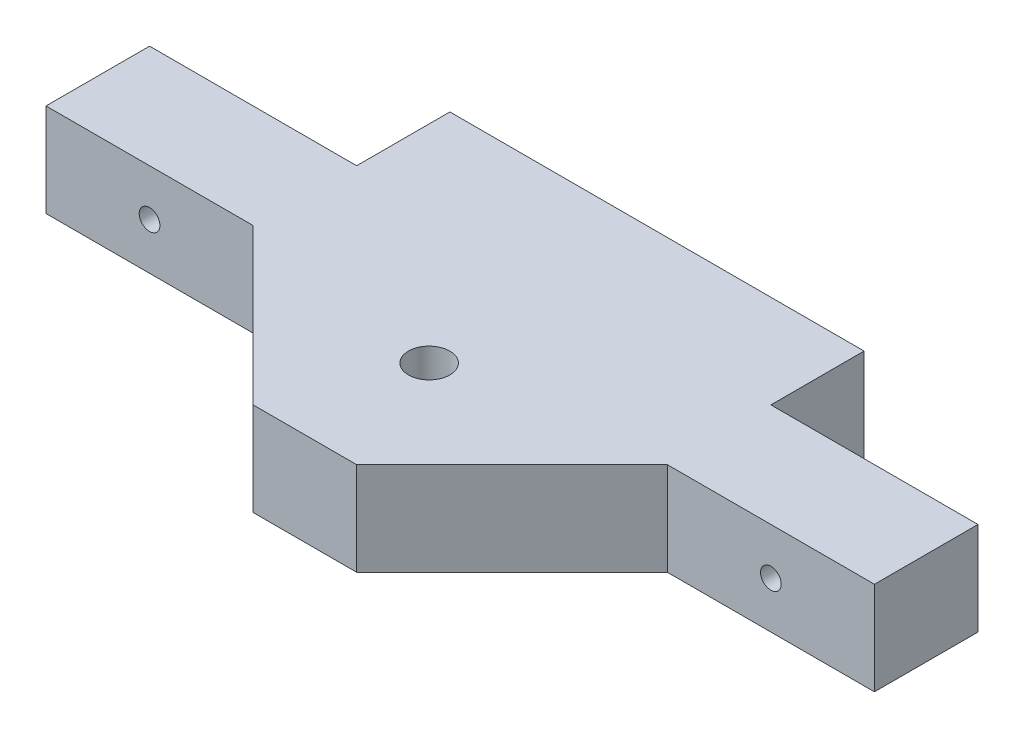
ISO-10303-21;
HEADER;
FILE_DESCRIPTION(('STEP AP214'),'2;1');
FILE_NAME('part.step','',(''),(''),'','','');
FILE_SCHEMA(('AUTOMOTIVE_DESIGN { 1 0 10303 214 1 1 1 1 }'));
ENDSEC;
DATA;
#1=APPLICATION_CONTEXT('core data for automotive mechanical design processes');
#2=APPLICATION_PROTOCOL_DEFINITION('international standard','automotive_design',2000,#1);
#3=PRODUCT_CONTEXT('',#1,'mechanical');
#4=PRODUCT('Part','Part','',(#3));
#5=PRODUCT_RELATED_PRODUCT_CATEGORY('part','',(#4));
#6=PRODUCT_DEFINITION_FORMATION('','',#4);
#7=PRODUCT_DEFINITION_CONTEXT('part definition',#1,'design');
#8=PRODUCT_DEFINITION('design','',#6,#7);
#9=PRODUCT_DEFINITION_SHAPE('','',#8);
#10=(LENGTH_UNIT() NAMED_UNIT(*) SI_UNIT(.MILLI.,.METRE.));
#11=(NAMED_UNIT(*) PLANE_ANGLE_UNIT() SI_UNIT($,.RADIAN.));
#12=(NAMED_UNIT(*) SI_UNIT($,.STERADIAN.) SOLID_ANGLE_UNIT());
#13=UNCERTAINTY_MEASURE_WITH_UNIT(LENGTH_MEASURE(1.E-05),#10,'distance_accuracy_value','');
#14=(GEOMETRIC_REPRESENTATION_CONTEXT(3) GLOBAL_UNCERTAINTY_ASSIGNED_CONTEXT((#13)) GLOBAL_UNIT_ASSIGNED_CONTEXT((#10,
#11,#12)) REPRESENTATION_CONTEXT('',''));
#15=CARTESIAN_POINT('',(0.,0.,0.));
#16=DIRECTION('',(0.,0.,1.));
#17=DIRECTION('',(1.,0.,0.));
#18=AXIS2_PLACEMENT_3D('',#15,#16,#17);
#19=CARTESIAN_POINT('',(0.,690.,50.));
#20=DIRECTION('',(0.,1.,0.));
#21=DIRECTION('',(0.,0.,1.));
#22=AXIS2_PLACEMENT_3D('',#19,#20,#21);
#23=PLANE('',#22);
#24=DIRECTION('',(-0.707106781186548,0.,-0.707106781186548));
#25=VECTOR('',#24,1.);
#26=CARTESIAN_POINT('',(-19.5,690.,19.5));
#27=LINE('',#26,#25);
#28=CARTESIAN_POINT('',(-4.99999999999999,690.,34.));
#29=VERTEX_POINT('',#28);
#30=CARTESIAN_POINT('',(-20.,690.,19.));
#31=VERTEX_POINT('',#30);
#32=EDGE_CURVE('E134',#29,#31,#27,.T.);
#33=ORIENTED_EDGE('',*,*,#32,.F.);
#34=DIRECTION('',(-1.,0.,0.));
#35=VECTOR('',#34,1.);
#36=CARTESIAN_POINT('',(0.,690.,34.));
#37=LINE('',#36,#35);
#38=CARTESIAN_POINT('',(5.,690.,34.));
#39=VERTEX_POINT('',#38);
#40=EDGE_CURVE('E181',#39,#29,#37,.T.);
#41=ORIENTED_EDGE('',*,*,#40,.F.);
#42=DIRECTION('',(0.707106781186548,0.,-0.707106781186547));
#43=VECTOR('',#42,1.);
#44=CARTESIAN_POINT('',(19.5,690.,19.5));
#45=LINE('',#44,#43);
#46=CARTESIAN_POINT('',(20.,690.,19.));
#47=VERTEX_POINT('',#46);
#48=EDGE_CURVE('E154',#39,#47,#45,.T.);
#49=ORIENTED_EDGE('',*,*,#48,.T.);
#50=DIRECTION('',(1.,0.,0.));
#51=VECTOR('',#50,1.);
#52=CARTESIAN_POINT('',(0.,690.,19.));
#53=LINE('',#52,#51);
#54=CARTESIAN_POINT('',(40.,690.,19.));
#55=VERTEX_POINT('',#54);
#56=EDGE_CURVE('E141',#47,#55,#53,.T.);
#57=ORIENTED_EDGE('',*,*,#56,.T.);
#58=DIRECTION('',(0.,0.,-1.));
#59=VECTOR('',#58,1.);
#60=CARTESIAN_POINT('',(40.,690.,34.));
#61=LINE('',#60,#59);
#62=CARTESIAN_POINT('',(40.,690.,9.));
#63=VERTEX_POINT('',#62);
#64=EDGE_CURVE('E203',#55,#63,#61,.T.);
#65=ORIENTED_EDGE('',*,*,#64,.T.);
#66=DIRECTION('',(-1.,0.,0.));
#67=VECTOR('',#66,1.);
#68=CARTESIAN_POINT('',(0.,690.,9.));
#69=LINE('',#68,#67);
#70=CARTESIAN_POINT('',(20.,690.,9.));
#71=VERTEX_POINT('',#70);
#72=EDGE_CURVE('E191',#63,#71,#69,.T.);
#73=ORIENTED_EDGE('',*,*,#72,.T.);
#74=DIRECTION('',(0.,0.,-1.));
#75=VECTOR('',#74,1.);
#76=CARTESIAN_POINT('',(20.,690.,50.));
#77=LINE('',#76,#75);
#78=CARTESIAN_POINT('',(20.,690.,0.));
#79=VERTEX_POINT('',#78);
#80=EDGE_CURVE('E212',#71,#79,#77,.T.);
#81=ORIENTED_EDGE('',*,*,#80,.T.);
#82=DIRECTION('',(1.,0.,0.));
#83=VECTOR('',#82,1.);
#84=CARTESIAN_POINT('',(0.,690.,0.));
#85=LINE('',#84,#83);
#86=CARTESIAN_POINT('',(-20.,690.,0.));
#87=VERTEX_POINT('',#86);
#88=EDGE_CURVE('E206',#87,#79,#85,.T.);
#89=ORIENTED_EDGE('',*,*,#88,.F.);
#90=DIRECTION('',(0.,0.,-1.));
#91=VECTOR('',#90,1.);
#92=CARTESIAN_POINT('',(-20.,690.,50.));
#93=LINE('',#92,#91);
#94=CARTESIAN_POINT('',(-20.,690.,9.));
#95=VERTEX_POINT('',#94);
#96=EDGE_CURVE('E43',#95,#87,#93,.T.);
#97=ORIENTED_EDGE('',*,*,#96,.F.);
#98=CARTESIAN_POINT('',(-40.,690.,9.));
#99=VERTEX_POINT('',#98);
#100=EDGE_CURVE('E190',#95,#99,#69,.T.);
#101=ORIENTED_EDGE('',*,*,#100,.T.);
#102=DIRECTION('',(0.,0.,-1.));
#103=VECTOR('',#102,1.);
#104=CARTESIAN_POINT('',(-40.,690.,34.));
#105=LINE('',#104,#103);
#106=CARTESIAN_POINT('',(-40.,690.,19.));
#107=VERTEX_POINT('',#106);
#108=EDGE_CURVE('E146',#107,#99,#105,.T.);
#109=ORIENTED_EDGE('',*,*,#108,.F.);
#110=DIRECTION('',(-1.,0.,0.));
#111=VECTOR('',#110,1.);
#112=CARTESIAN_POINT('',(0.,690.,19.));
#113=LINE('',#112,#111);
#114=EDGE_CURVE('E59',#31,#107,#113,.T.);
#115=ORIENTED_EDGE('',*,*,#114,.F.);
#116=EDGE_LOOP('',(#33,#41,#49,#57,#65,#73,#81,#89,#97,#101,#109,#115));
#117=FACE_BOUND('',#116,.T.);
#118=CARTESIAN_POINT('',(0.,690.,22.));
#119=DIRECTION('',(0.,1.,0.));
#120=DIRECTION('',(0.,0.,1.));
#121=AXIS2_PLACEMENT_3D('',#118,#119,#120);
#122=CIRCLE('',#121,2.);
#123=CARTESIAN_POINT('',(0.,690.,24.));
#124=VERTEX_POINT('',#123);
#125=EDGE_CURVE('E160',#124,#124,#122,.T.);
#126=ORIENTED_EDGE('',*,*,#125,.F.);
#127=EDGE_LOOP('',(#126));
#128=FACE_BOUND('',#127,.T.);
#129=ADVANCED_FACE('F35',(#117,#128),#23,.T.);
#130=CARTESIAN_POINT('',(0.,681.,50.));
#131=DIRECTION('',(0.,1.,0.));
#132=DIRECTION('',(0.,0.,1.));
#133=AXIS2_PLACEMENT_3D('',#130,#131,#132);
#134=PLANE('',#133);
#135=CARTESIAN_POINT('',(0.,681.,22.));
#136=DIRECTION('',(0.,1.,0.));
#137=DIRECTION('',(0.,0.,1.));
#138=AXIS2_PLACEMENT_3D('',#135,#136,#137);
#139=CIRCLE('',#138,2.);
#140=CARTESIAN_POINT('',(0.,681.,24.));
#141=VERTEX_POINT('',#140);
#142=EDGE_CURVE('E38',#141,#141,#139,.T.);
#143=ORIENTED_EDGE('',*,*,#142,.T.);
#144=EDGE_LOOP('',(#143));
#145=FACE_BOUND('',#144,.T.);
#146=DIRECTION('',(-1.,0.,0.));
#147=VECTOR('',#146,1.);
#148=CARTESIAN_POINT('',(0.,681.,34.));
#149=LINE('',#148,#147);
#150=CARTESIAN_POINT('',(5.,681.,34.));
#151=VERTEX_POINT('',#150);
#152=CARTESIAN_POINT('',(-4.99999999999999,681.,34.));
#153=VERTEX_POINT('',#152);
#154=EDGE_CURVE('E183',#151,#153,#149,.T.);
#155=ORIENTED_EDGE('',*,*,#154,.T.);
#156=DIRECTION('',(-0.707106781186548,0.,-0.707106781186548));
#157=VECTOR('',#156,1.);
#158=CARTESIAN_POINT('',(5.5,681.,44.5));
#159=LINE('',#158,#157);
#160=CARTESIAN_POINT('',(-20.,681.,19.));
#161=VERTEX_POINT('',#160);
#162=EDGE_CURVE('E172',#153,#161,#159,.T.);
#163=ORIENTED_EDGE('',*,*,#162,.T.);
#164=DIRECTION('',(-1.,0.,0.));
#165=VECTOR('',#164,1.);
#166=CARTESIAN_POINT('',(0.,681.,19.));
#167=LINE('',#166,#165);
#168=CARTESIAN_POINT('',(-40.,681.,19.));
#169=VERTEX_POINT('',#168);
#170=EDGE_CURVE('E128',#161,#169,#167,.T.);
#171=ORIENTED_EDGE('',*,*,#170,.T.);
#172=DIRECTION('',(0.,0.,-1.));
#173=VECTOR('',#172,1.);
#174=CARTESIAN_POINT('',(-40.,681.,34.));
#175=LINE('',#174,#173);
#176=CARTESIAN_POINT('',(-40.,681.,9.));
#177=VERTEX_POINT('',#176);
#178=EDGE_CURVE('E200',#169,#177,#175,.T.);
#179=ORIENTED_EDGE('',*,*,#178,.T.);
#180=DIRECTION('',(-1.,0.,0.));
#181=VECTOR('',#180,1.);
#182=CARTESIAN_POINT('',(0.,681.,9.));
#183=LINE('',#182,#181);
#184=CARTESIAN_POINT('',(-20.,681.,9.));
#185=VERTEX_POINT('',#184);
#186=EDGE_CURVE('E197',#185,#177,#183,.T.);
#187=ORIENTED_EDGE('',*,*,#186,.F.);
#188=DIRECTION('',(0.,0.,-1.));
#189=VECTOR('',#188,1.);
#190=CARTESIAN_POINT('',(-20.,681.,50.));
#191=LINE('',#190,#189);
#192=CARTESIAN_POINT('',(-20.,681.,0.));
#193=VERTEX_POINT('',#192);
#194=EDGE_CURVE('E215',#185,#193,#191,.T.);
#195=ORIENTED_EDGE('',*,*,#194,.T.);
#196=DIRECTION('',(1.,0.,0.));
#197=VECTOR('',#196,1.);
#198=CARTESIAN_POINT('',(0.,681.,0.));
#199=LINE('',#198,#197);
#200=CARTESIAN_POINT('',(20.,681.,0.));
#201=VERTEX_POINT('',#200);
#202=EDGE_CURVE('E213',#193,#201,#199,.T.);
#203=ORIENTED_EDGE('',*,*,#202,.T.);
#204=DIRECTION('',(0.,0.,-1.));
#205=VECTOR('',#204,1.);
#206=CARTESIAN_POINT('',(20.,681.,50.));
#207=LINE('',#206,#205);
#208=CARTESIAN_POINT('',(20.,681.,9.));
#209=VERTEX_POINT('',#208);
#210=EDGE_CURVE('E221',#209,#201,#207,.T.);
#211=ORIENTED_EDGE('',*,*,#210,.F.);
#212=CARTESIAN_POINT('',(40.,681.,9.));
#213=VERTEX_POINT('',#212);
#214=EDGE_CURVE('E184',#213,#209,#183,.T.);
#215=ORIENTED_EDGE('',*,*,#214,.F.);
#216=DIRECTION('',(0.,0.,-1.));
#217=VECTOR('',#216,1.);
#218=CARTESIAN_POINT('',(40.,681.,34.));
#219=LINE('',#218,#217);
#220=CARTESIAN_POINT('',(40.,681.,19.));
#221=VERTEX_POINT('',#220);
#222=EDGE_CURVE('E187',#221,#213,#219,.T.);
#223=ORIENTED_EDGE('',*,*,#222,.F.);
#224=DIRECTION('',(1.,0.,0.));
#225=VECTOR('',#224,1.);
#226=CARTESIAN_POINT('',(0.,681.,19.));
#227=LINE('',#226,#225);
#228=CARTESIAN_POINT('',(20.,681.,19.));
#229=VERTEX_POINT('',#228);
#230=EDGE_CURVE('E51',#229,#221,#227,.T.);
#231=ORIENTED_EDGE('',*,*,#230,.F.);
#232=DIRECTION('',(0.707106781186548,0.,-0.707106781186547));
#233=VECTOR('',#232,1.);
#234=CARTESIAN_POINT('',(-5.5,681.,44.5));
#235=LINE('',#234,#233);
#236=EDGE_CURVE('E170',#151,#229,#235,.T.);
#237=ORIENTED_EDGE('',*,*,#236,.F.);
#238=EDGE_LOOP('',(#155,#163,#171,#179,#187,#195,#203,#211,#215,#223,#231,#237));
#239=FACE_BOUND('',#238,.T.);
#240=ADVANCED_FACE('F261',(#145,#239),#134,.F.);
#241=CARTESIAN_POINT('',(0.,0.,34.));
#242=DIRECTION('',(0.,0.,1.));
#243=DIRECTION('',(1.,0.,0.));
#244=AXIS2_PLACEMENT_3D('',#241,#242,#243);
#245=PLANE('',#244);
#246=DIRECTION('',(0.,1.,0.));
#247=VECTOR('',#246,1.);
#248=CARTESIAN_POINT('',(-4.99999999999999,675.,34.));
#249=LINE('',#248,#247);
#250=EDGE_CURVE('E137',#153,#29,#249,.T.);
#251=ORIENTED_EDGE('',*,*,#250,.F.);
#252=ORIENTED_EDGE('',*,*,#154,.F.);
#253=DIRECTION('',(0.,1.,0.));
#254=VECTOR('',#253,1.);
#255=CARTESIAN_POINT('',(5.,675.,34.));
#256=LINE('',#255,#254);
#257=EDGE_CURVE('E155',#151,#39,#256,.T.);
#258=ORIENTED_EDGE('',*,*,#257,.T.);
#259=ORIENTED_EDGE('',*,*,#40,.T.);
#260=EDGE_LOOP('',(#251,#252,#258,#259));
#261=FACE_BOUND('',#260,.T.);
#262=ADVANCED_FACE('F268',(#261),#245,.T.);
#263=CARTESIAN_POINT('',(40.0000000000005,0.,34.));
#264=DIRECTION('',(-1.,0.,0.));
#265=DIRECTION('',(0.,-1.,0.));
#266=AXIS2_PLACEMENT_3D('',#263,#264,#265);
#267=PLANE('',#266);
#268=DIRECTION('',(0.,1.,0.));
#269=VECTOR('',#268,1.);
#270=CARTESIAN_POINT('',(40.,675.,19.));
#271=LINE('',#270,#269);
#272=EDGE_CURVE('E158',#221,#55,#271,.T.);
#273=ORIENTED_EDGE('',*,*,#272,.F.);
#274=ORIENTED_EDGE('',*,*,#222,.T.);
#275=DIRECTION('',(0.,1.,0.));
#276=VECTOR('',#275,1.);
#277=CARTESIAN_POINT('',(40.0000000000005,0.,9.));
#278=LINE('',#277,#276);
#279=EDGE_CURVE('E180',#213,#63,#278,.T.);
#280=ORIENTED_EDGE('',*,*,#279,.T.);
#281=ORIENTED_EDGE('',*,*,#64,.F.);
#282=EDGE_LOOP('',(#273,#274,#280,#281));
#283=FACE_BOUND('',#282,.T.);
#284=ADVANCED_FACE('F275',(#283),#267,.F.);
#285=CARTESIAN_POINT('',(30.,685.5,34.));
#286=DIRECTION('',(0.,0.,-1.));
#287=DIRECTION('',(-1.,0.,0.));
#288=AXIS2_PLACEMENT_3D('',#285,#286,#287);
#289=CYLINDRICAL_SURFACE('',#288,1.);
#290=CARTESIAN_POINT('',(30.,685.5,9.));
#291=DIRECTION('',(0.,0.,1.));
#292=DIRECTION('',(1.,0.,0.));
#293=AXIS2_PLACEMENT_3D('',#290,#291,#292);
#294=CIRCLE('',#293,1.);
#295=CARTESIAN_POINT('',(31.,685.5,9.));
#296=VERTEX_POINT('',#295);
#297=EDGE_CURVE('E174',#296,#296,#294,.T.);
#298=ORIENTED_EDGE('',*,*,#297,.F.);
#299=EDGE_LOOP('',(#298));
#300=FACE_BOUND('',#299,.T.);
#301=CARTESIAN_POINT('',(30.,685.5,19.));
#302=DIRECTION('',(0.,0.,1.));
#303=DIRECTION('',(1.,0.,0.));
#304=AXIS2_PLACEMENT_3D('',#301,#302,#303);
#305=CIRCLE('',#304,1.);
#306=CARTESIAN_POINT('',(31.,685.5,19.));
#307=VERTEX_POINT('',#306);
#308=EDGE_CURVE('E150',#307,#307,#305,.T.);
#309=ORIENTED_EDGE('',*,*,#308,.T.);
#310=EDGE_LOOP('',(#309));
#311=FACE_BOUND('',#310,.T.);
#312=ADVANCED_FACE('F288',(#300,#311),#289,.F.);
#313=CARTESIAN_POINT('',(0.,0.,0.));
#314=DIRECTION('',(0.,0.,1.));
#315=DIRECTION('',(1.,0.,0.));
#316=AXIS2_PLACEMENT_3D('',#313,#314,#315);
#317=PLANE('',#316);
#318=DIRECTION('',(0.,-1.,0.));
#319=VECTOR('',#318,1.);
#320=CARTESIAN_POINT('',(-19.9999999999997,0.,0.));
#321=LINE('',#320,#319);
#322=EDGE_CURVE('E11',#87,#193,#321,.T.);
#323=ORIENTED_EDGE('',*,*,#322,.F.);
#324=ORIENTED_EDGE('',*,*,#88,.T.);
#325=DIRECTION('',(0.,-1.,0.));
#326=VECTOR('',#325,1.);
#327=CARTESIAN_POINT('',(19.9999999999997,0.,0.));
#328=LINE('',#327,#326);
#329=EDGE_CURVE('E209',#79,#201,#328,.T.);
#330=ORIENTED_EDGE('',*,*,#329,.T.);
#331=ORIENTED_EDGE('',*,*,#202,.F.);
#332=EDGE_LOOP('',(#323,#324,#330,#331));
#333=FACE_BOUND('',#332,.T.);
#334=ADVANCED_FACE('F257',(#333),#317,.F.);
#335=CARTESIAN_POINT('',(19.9999999999997,0.,50.));
#336=DIRECTION('',(1.,0.,0.));
#337=DIRECTION('',(0.,1.,0.));
#338=AXIS2_PLACEMENT_3D('',#335,#336,#337);
#339=PLANE('',#338);
#340=ORIENTED_EDGE('',*,*,#80,.F.);
#341=DIRECTION('',(0.,-1.,0.));
#342=VECTOR('',#341,1.);
#343=CARTESIAN_POINT('',(19.9999999999997,0.,9.));
#344=LINE('',#343,#342);
#345=EDGE_CURVE('E218',#71,#209,#344,.T.);
#346=ORIENTED_EDGE('',*,*,#345,.T.);
#347=ORIENTED_EDGE('',*,*,#210,.T.);
#348=ORIENTED_EDGE('',*,*,#329,.F.);
#349=EDGE_LOOP('',(#340,#346,#347,#348));
#350=FACE_BOUND('',#349,.T.);
#351=ADVANCED_FACE('F281',(#350),#339,.T.);
#352=CARTESIAN_POINT('',(-19.9999999999997,0.,50.));
#353=DIRECTION('',(1.,0.,0.));
#354=DIRECTION('',(0.,1.,0.));
#355=AXIS2_PLACEMENT_3D('',#352,#353,#354);
#356=PLANE('',#355);
#357=DIRECTION('',(0.,-1.,0.));
#358=VECTOR('',#357,1.);
#359=CARTESIAN_POINT('',(-19.9999999999997,0.,9.));
#360=LINE('',#359,#358);
#361=EDGE_CURVE('E205',#95,#185,#360,.T.);
#362=ORIENTED_EDGE('',*,*,#361,.F.);
#363=ORIENTED_EDGE('',*,*,#96,.T.);
#364=ORIENTED_EDGE('',*,*,#322,.T.);
#365=ORIENTED_EDGE('',*,*,#194,.F.);
#366=EDGE_LOOP('',(#362,#363,#364,#365));
#367=FACE_BOUND('',#366,.T.);
#368=ADVANCED_FACE('F243',(#367),#356,.F.);
#369=CARTESIAN_POINT('',(0.,0.,9.));
#370=DIRECTION('',(0.,0.,1.));
#371=DIRECTION('',(1.,0.,0.));
#372=AXIS2_PLACEMENT_3D('',#369,#370,#371);
#373=PLANE('',#372);
#374=CARTESIAN_POINT('',(-30.,685.5,9.));
#375=DIRECTION('',(0.,0.,1.));
#376=DIRECTION('',(1.,0.,0.));
#377=AXIS2_PLACEMENT_3D('',#374,#375,#376);
#378=CIRCLE('',#377,1.);
#379=CARTESIAN_POINT('',(-29.,685.5,9.));
#380=VERTEX_POINT('',#379);
#381=EDGE_CURVE('E177',#380,#380,#378,.T.);
#382=ORIENTED_EDGE('',*,*,#381,.T.);
#383=EDGE_LOOP('',(#382));
#384=FACE_BOUND('',#383,.T.);
#385=ORIENTED_EDGE('',*,*,#100,.F.);
#386=ORIENTED_EDGE('',*,*,#361,.T.);
#387=ORIENTED_EDGE('',*,*,#186,.T.);
#388=DIRECTION('',(0.,1.,0.));
#389=VECTOR('',#388,1.);
#390=CARTESIAN_POINT('',(-40.0000000000005,0.,9.));
#391=LINE('',#390,#389);
#392=EDGE_CURVE('E194',#177,#99,#391,.T.);
#393=ORIENTED_EDGE('',*,*,#392,.T.);
#394=EDGE_LOOP('',(#385,#386,#387,#393));
#395=FACE_BOUND('',#394,.T.);
#396=ADVANCED_FACE('F239',(#384,#395),#373,.F.);
#397=ORIENTED_EDGE('',*,*,#345,.F.);
#398=ORIENTED_EDGE('',*,*,#72,.F.);
#399=ORIENTED_EDGE('',*,*,#279,.F.);
#400=ORIENTED_EDGE('',*,*,#214,.T.);
#401=EDGE_LOOP('',(#397,#398,#399,#400));
#402=FACE_BOUND('',#401,.T.);
#403=ORIENTED_EDGE('',*,*,#297,.T.);
#404=EDGE_LOOP('',(#403));
#405=FACE_BOUND('',#404,.T.);
#406=ADVANCED_FACE('F242',(#402,#405),#373,.F.);
#407=CARTESIAN_POINT('',(-40.0000000000005,0.,34.));
#408=DIRECTION('',(-1.,0.,0.));
#409=DIRECTION('',(0.,-1.,0.));
#410=AXIS2_PLACEMENT_3D('',#407,#408,#409);
#411=PLANE('',#410);
#412=DIRECTION('',(0.,1.,0.));
#413=VECTOR('',#412,1.);
#414=CARTESIAN_POINT('',(-40.,675.,19.));
#415=LINE('',#414,#413);
#416=EDGE_CURVE('E131',#169,#107,#415,.T.);
#417=ORIENTED_EDGE('',*,*,#416,.T.);
#418=ORIENTED_EDGE('',*,*,#108,.T.);
#419=ORIENTED_EDGE('',*,*,#392,.F.);
#420=ORIENTED_EDGE('',*,*,#178,.F.);
#421=EDGE_LOOP('',(#417,#418,#419,#420));
#422=FACE_BOUND('',#421,.T.);
#423=ADVANCED_FACE('F235',(#422),#411,.T.);
#424=CARTESIAN_POINT('',(-30.,685.5,34.));
#425=DIRECTION('',(0.,0.,-1.));
#426=DIRECTION('',(-1.,0.,0.));
#427=AXIS2_PLACEMENT_3D('',#424,#425,#426);
#428=CYLINDRICAL_SURFACE('',#427,1.);
#429=CARTESIAN_POINT('',(-30.,685.5,19.));
#430=DIRECTION('',(0.,0.,-1.));
#431=DIRECTION('',(-1.,0.,0.));
#432=AXIS2_PLACEMENT_3D('',#429,#430,#431);
#433=CIRCLE('',#432,1.);
#434=CARTESIAN_POINT('',(-31.,685.5,19.));
#435=VERTEX_POINT('',#434);
#436=EDGE_CURVE('E168',#435,#435,#433,.T.);
#437=ORIENTED_EDGE('',*,*,#436,.F.);
#438=EDGE_LOOP('',(#437));
#439=FACE_BOUND('',#438,.T.);
#440=ORIENTED_EDGE('',*,*,#381,.F.);
#441=EDGE_LOOP('',(#440));
#442=FACE_BOUND('',#441,.T.);
#443=ADVANCED_FACE('F231',(#439,#442),#428,.F.);
#444=CARTESIAN_POINT('',(19.5,675.,19.5));
#445=DIRECTION('',(0.707106781186547,0.,0.707106781186548));
#446=DIRECTION('',(0.707106781186548,0.,-0.707106781186547));
#447=AXIS2_PLACEMENT_3D('',#444,#445,#446);
#448=PLANE('',#447);
#449=ORIENTED_EDGE('',*,*,#236,.T.);
#450=DIRECTION('',(0.,1.,0.));
#451=VECTOR('',#450,1.);
#452=CARTESIAN_POINT('',(20.,675.,19.));
#453=LINE('',#452,#451);
#454=EDGE_CURVE('E152',#229,#47,#453,.T.);
#455=ORIENTED_EDGE('',*,*,#454,.T.);
#456=ORIENTED_EDGE('',*,*,#48,.F.);
#457=ORIENTED_EDGE('',*,*,#257,.F.);
#458=EDGE_LOOP('',(#449,#455,#456,#457));
#459=FACE_BOUND('',#458,.T.);
#460=ADVANCED_FACE('F234',(#459),#448,.T.);
#461=CARTESIAN_POINT('',(0.,675.,19.));
#462=DIRECTION('',(0.,0.,1.));
#463=DIRECTION('',(1.,0.,0.));
#464=AXIS2_PLACEMENT_3D('',#461,#462,#463);
#465=PLANE('',#464);
#466=ORIENTED_EDGE('',*,*,#308,.F.);
#467=EDGE_LOOP('',(#466));
#468=FACE_BOUND('',#467,.T.);
#469=ORIENTED_EDGE('',*,*,#230,.T.);
#470=ORIENTED_EDGE('',*,*,#272,.T.);
#471=ORIENTED_EDGE('',*,*,#56,.F.);
#472=ORIENTED_EDGE('',*,*,#454,.F.);
#473=EDGE_LOOP('',(#469,#470,#471,#472));
#474=FACE_BOUND('',#473,.T.);
#475=ADVANCED_FACE('F272',(#468,#474),#465,.T.);
#476=CARTESIAN_POINT('',(-19.5,675.,19.5));
#477=DIRECTION('',(0.707106781186547,0.,-0.707106781186547));
#478=DIRECTION('',(-0.707106781186548,0.,-0.707106781186548));
#479=AXIS2_PLACEMENT_3D('',#476,#477,#478);
#480=PLANE('',#479);
#481=ORIENTED_EDGE('',*,*,#250,.T.);
#482=ORIENTED_EDGE('',*,*,#32,.T.);
#483=DIRECTION('',(0.,1.,0.));
#484=VECTOR('',#483,1.);
#485=CARTESIAN_POINT('',(-20.,675.,19.));
#486=LINE('',#485,#484);
#487=EDGE_CURVE('E124',#161,#31,#486,.T.);
#488=ORIENTED_EDGE('',*,*,#487,.F.);
#489=ORIENTED_EDGE('',*,*,#162,.F.);
#490=EDGE_LOOP('',(#481,#482,#488,#489));
#491=FACE_BOUND('',#490,.T.);
#492=ADVANCED_FACE('F135',(#491),#480,.F.);
#493=CARTESIAN_POINT('',(0.,675.,19.));
#494=DIRECTION('',(0.,0.,-1.));
#495=DIRECTION('',(-1.,0.,0.));
#496=AXIS2_PLACEMENT_3D('',#493,#494,#495);
#497=PLANE('',#496);
#498=ORIENTED_EDGE('',*,*,#436,.T.);
#499=EDGE_LOOP('',(#498));
#500=FACE_BOUND('',#499,.T.);
#501=ORIENTED_EDGE('',*,*,#487,.T.);
#502=ORIENTED_EDGE('',*,*,#114,.T.);
#503=ORIENTED_EDGE('',*,*,#416,.F.);
#504=ORIENTED_EDGE('',*,*,#170,.F.);
#505=EDGE_LOOP('',(#501,#502,#503,#504));
#506=FACE_BOUND('',#505,.T.);
#507=ADVANCED_FACE('F126',(#500,#506),#497,.F.);
#508=CARTESIAN_POINT('',(0.,675.,22.));
#509=DIRECTION('',(0.,1.,0.));
#510=DIRECTION('',(0.,0.,1.));
#511=AXIS2_PLACEMENT_3D('',#508,#509,#510);
#512=CYLINDRICAL_SURFACE('',#511,2.);
#513=ORIENTED_EDGE('',*,*,#125,.T.);
#514=EDGE_LOOP('',(#513));
#515=FACE_BOUND('',#514,.T.);
#516=ORIENTED_EDGE('',*,*,#142,.F.);
#517=EDGE_LOOP('',(#516));
#518=FACE_BOUND('',#517,.T.);
#519=ADVANCED_FACE('F310',(#515,#518),#512,.F.);
#520=CLOSED_SHELL('',(#129,#240,#262,#284,#312,#334,#351,#368,#396,#406,#423,#443,#460,#475,
#492,#507,#519));
#521=MANIFOLD_SOLID_BREP('B2',#520);
#522=ADVANCED_BREP_SHAPE_REPRESENTATION('',(#18,#521),#14);
#523=SHAPE_DEFINITION_REPRESENTATION(#9,#522);
ENDSEC;
END-ISO-10303-21;
